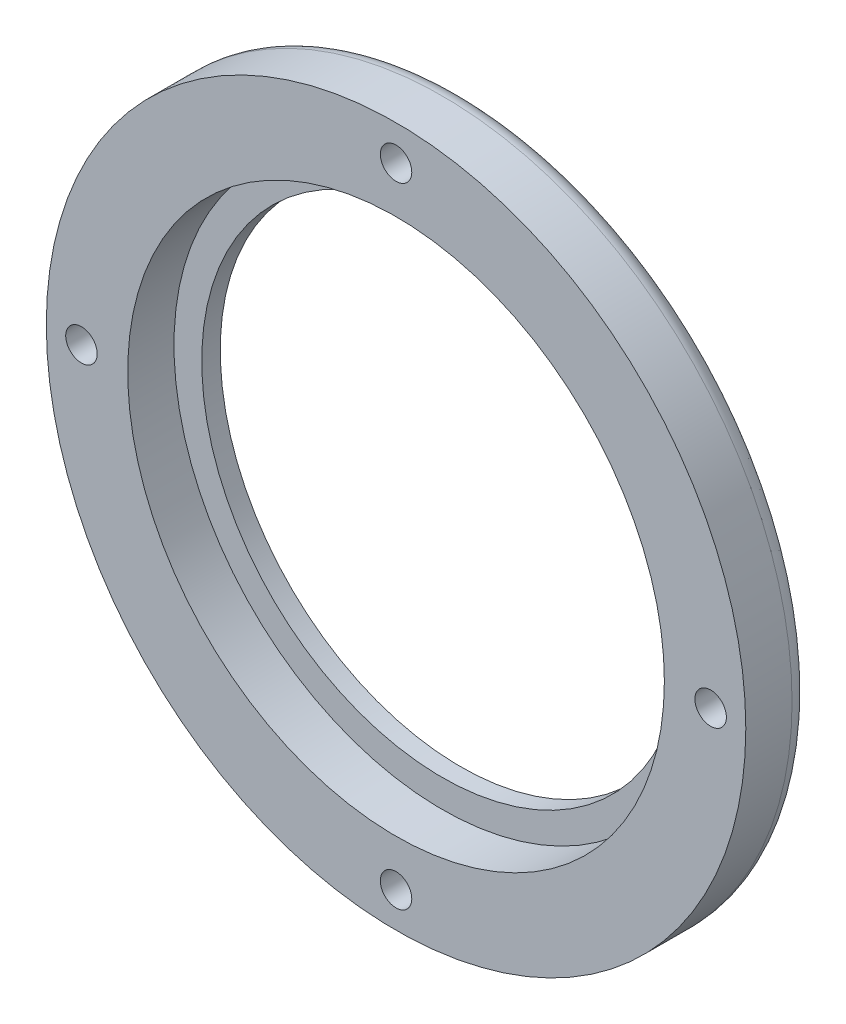
ISO-10303-21;
HEADER;
FILE_DESCRIPTION(('STEP AP214'),'2;1');
FILE_NAME('part.step','',(''),(''),'','','');
FILE_SCHEMA(('AUTOMOTIVE_DESIGN { 1 0 10303 214 1 1 1 1 }'));
ENDSEC;
DATA;
#1=APPLICATION_CONTEXT('core data for automotive mechanical design processes');
#2=APPLICATION_PROTOCOL_DEFINITION('international standard','automotive_design',2000,#1);
#3=PRODUCT_CONTEXT('',#1,'mechanical');
#4=PRODUCT('Part','Part','',(#3));
#5=PRODUCT_RELATED_PRODUCT_CATEGORY('part','',(#4));
#6=PRODUCT_DEFINITION_FORMATION('','',#4);
#7=PRODUCT_DEFINITION_CONTEXT('part definition',#1,'design');
#8=PRODUCT_DEFINITION('design','',#6,#7);
#9=PRODUCT_DEFINITION_SHAPE('','',#8);
#10=(LENGTH_UNIT() NAMED_UNIT(*) SI_UNIT(.MILLI.,.METRE.));
#11=(NAMED_UNIT(*) PLANE_ANGLE_UNIT() SI_UNIT($,.RADIAN.));
#12=(NAMED_UNIT(*) SI_UNIT($,.STERADIAN.) SOLID_ANGLE_UNIT());
#13=UNCERTAINTY_MEASURE_WITH_UNIT(LENGTH_MEASURE(1.E-05),#10,'distance_accuracy_value','');
#14=(GEOMETRIC_REPRESENTATION_CONTEXT(3) GLOBAL_UNCERTAINTY_ASSIGNED_CONTEXT((#13)) GLOBAL_UNIT_ASSIGNED_CONTEXT((#10,
#11,#12)) REPRESENTATION_CONTEXT('',''));
#15=CARTESIAN_POINT('',(0.,0.,0.));
#16=DIRECTION('',(0.,0.,1.));
#17=DIRECTION('',(1.,0.,0.));
#18=AXIS2_PLACEMENT_3D('',#15,#16,#17);
#19=CARTESIAN_POINT('',(34.,-3.58906191348806E-13,-1.));
#20=DIRECTION('',(0.,0.,1.));
#21=DIRECTION('',(1.,0.,0.));
#22=AXIS2_PLACEMENT_3D('',#19,#20,#21);
#23=CYLINDRICAL_SURFACE('',#22,1.7);
#24=CARTESIAN_POINT('',(34.,-3.58906191348806E-13,7.));
#25=DIRECTION('',(0.,0.,1.));
#26=DIRECTION('',(1.,0.,0.));
#27=AXIS2_PLACEMENT_3D('',#24,#25,#26);
#28=CIRCLE('',#27,1.7);
#29=CARTESIAN_POINT('',(35.7,-3.58906191348806E-13,7.));
#30=VERTEX_POINT('',#29);
#31=EDGE_CURVE('E130',#30,#30,#28,.T.);
#32=ORIENTED_EDGE('',*,*,#31,.T.);
#33=EDGE_LOOP('',(#32));
#34=FACE_BOUND('',#33,.T.);
#35=CARTESIAN_POINT('',(34.,-3.58906191348806E-13,2.5));
#36=DIRECTION('',(0.,0.,-1.));
#37=DIRECTION('',(-1.,0.,0.));
#38=AXIS2_PLACEMENT_3D('',#35,#36,#37);
#39=CIRCLE('',#38,1.7);
#40=CARTESIAN_POINT('',(32.3,-3.58906191348806E-13,2.5));
#41=VERTEX_POINT('',#40);
#42=EDGE_CURVE('E128',#41,#41,#39,.F.);
#43=ORIENTED_EDGE('',*,*,#42,.F.);
#44=EDGE_LOOP('',(#43));
#45=FACE_BOUND('',#44,.T.);
#46=ADVANCED_FACE('F40',(#34,#45),#23,.F.);
#47=CARTESIAN_POINT('',(2.33256931924232E-13,34.,-1.));
#48=DIRECTION('',(0.,0.,1.));
#49=DIRECTION('',(1.,0.,0.));
#50=AXIS2_PLACEMENT_3D('',#47,#48,#49);
#51=CYLINDRICAL_SURFACE('',#50,1.7);
#52=CARTESIAN_POINT('',(2.33256931924232E-13,34.,7.));
#53=DIRECTION('',(0.,0.,1.));
#54=DIRECTION('',(1.,0.,0.));
#55=AXIS2_PLACEMENT_3D('',#52,#53,#54);
#56=CIRCLE('',#55,1.7);
#57=CARTESIAN_POINT('',(1.70000000000023,34.,7.));
#58=VERTEX_POINT('',#57);
#59=EDGE_CURVE('E215',#58,#58,#56,.T.);
#60=ORIENTED_EDGE('',*,*,#59,.T.);
#61=EDGE_LOOP('',(#60));
#62=FACE_BOUND('',#61,.T.);
#63=CARTESIAN_POINT('',(2.33256931924232E-13,34.,2.5));
#64=DIRECTION('',(0.,0.,-1.));
#65=DIRECTION('',(-1.,0.,0.));
#66=AXIS2_PLACEMENT_3D('',#63,#64,#65);
#67=CIRCLE('',#66,1.7);
#68=CARTESIAN_POINT('',(-1.69999999999977,34.,2.5));
#69=VERTEX_POINT('',#68);
#70=EDGE_CURVE('E125',#69,#69,#67,.F.);
#71=ORIENTED_EDGE('',*,*,#70,.F.);
#72=EDGE_LOOP('',(#71));
#73=FACE_BOUND('',#72,.T.);
#74=ADVANCED_FACE('F159',(#62,#73),#51,.F.);
#75=CARTESIAN_POINT('',(-34.,1.21485460307473E-13,-1.));
#76=DIRECTION('',(0.,0.,1.));
#77=DIRECTION('',(1.,0.,0.));
#78=AXIS2_PLACEMENT_3D('',#75,#76,#77);
#79=CYLINDRICAL_SURFACE('',#78,1.7);
#80=CARTESIAN_POINT('',(-34.,1.21485460307473E-13,7.));
#81=DIRECTION('',(0.,0.,1.));
#82=DIRECTION('',(1.,0.,0.));
#83=AXIS2_PLACEMENT_3D('',#80,#81,#82);
#84=CIRCLE('',#83,1.7);
#85=CARTESIAN_POINT('',(-32.3,1.21485460307473E-13,7.));
#86=VERTEX_POINT('',#85);
#87=EDGE_CURVE('E218',#86,#86,#84,.T.);
#88=ORIENTED_EDGE('',*,*,#87,.T.);
#89=EDGE_LOOP('',(#88));
#90=FACE_BOUND('',#89,.T.);
#91=CARTESIAN_POINT('',(-34.,1.21485460307473E-13,2.5));
#92=DIRECTION('',(0.,0.,-1.));
#93=DIRECTION('',(-1.,0.,0.));
#94=AXIS2_PLACEMENT_3D('',#91,#92,#93);
#95=CIRCLE('',#94,1.7);
#96=CARTESIAN_POINT('',(-35.7,1.21485460307473E-13,2.5));
#97=VERTEX_POINT('',#96);
#98=EDGE_CURVE('E121',#97,#97,#95,.F.);
#99=ORIENTED_EDGE('',*,*,#98,.F.);
#100=EDGE_LOOP('',(#99));
#101=FACE_BOUND('',#100,.T.);
#102=ADVANCED_FACE('F155',(#90,#101),#79,.F.);
#103=CARTESIAN_POINT('',(0.,-34.,-1.));
#104=DIRECTION('',(0.,0.,1.));
#105=DIRECTION('',(1.,0.,0.));
#106=AXIS2_PLACEMENT_3D('',#103,#104,#105);
#107=CYLINDRICAL_SURFACE('',#106,1.7);
#108=CARTESIAN_POINT('',(0.,-34.,7.));
#109=DIRECTION('',(0.,0.,1.));
#110=DIRECTION('',(1.,0.,0.));
#111=AXIS2_PLACEMENT_3D('',#108,#109,#110);
#112=CIRCLE('',#111,1.7);
#113=CARTESIAN_POINT('',(1.7,-34.,7.));
#114=VERTEX_POINT('',#113);
#115=EDGE_CURVE('E211',#114,#114,#112,.T.);
#116=ORIENTED_EDGE('',*,*,#115,.T.);
#117=EDGE_LOOP('',(#116));
#118=FACE_BOUND('',#117,.T.);
#119=CARTESIAN_POINT('',(0.,-34.,2.5));
#120=DIRECTION('',(0.,0.,-1.));
#121=DIRECTION('',(-1.,0.,0.));
#122=AXIS2_PLACEMENT_3D('',#119,#120,#121);
#123=CIRCLE('',#122,1.7);
#124=CARTESIAN_POINT('',(-1.7,-34.,2.5));
#125=VERTEX_POINT('',#124);
#126=EDGE_CURVE('E118',#125,#125,#123,.F.);
#127=ORIENTED_EDGE('',*,*,#126,.F.);
#128=EDGE_LOOP('',(#127));
#129=FACE_BOUND('',#128,.T.);
#130=ADVANCED_FACE('F151',(#118,#129),#107,.F.);
#131=CARTESIAN_POINT('',(0.,0.,7.));
#132=DIRECTION('',(0.,0.,-1.));
#133=DIRECTION('',(-1.,0.,0.));
#134=AXIS2_PLACEMENT_3D('',#131,#132,#133);
#135=CYLINDRICAL_SURFACE('',#134,26.);
#136=CARTESIAN_POINT('',(0.,0.,0.));
#137=DIRECTION('',(0.,0.,1.));
#138=DIRECTION('',(1.,0.,0.));
#139=AXIS2_PLACEMENT_3D('',#136,#137,#138);
#140=CIRCLE('',#139,26.);
#141=CARTESIAN_POINT('',(26.,0.,0.));
#142=VERTEX_POINT('',#141);
#143=EDGE_CURVE('E195',#142,#142,#140,.T.);
#144=ORIENTED_EDGE('',*,*,#143,.F.);
#145=EDGE_LOOP('',(#144));
#146=FACE_BOUND('',#145,.T.);
#147=CARTESIAN_POINT('',(0.,0.,2.));
#148=DIRECTION('',(0.,0.,1.));
#149=DIRECTION('',(1.,0.,0.));
#150=AXIS2_PLACEMENT_3D('',#147,#148,#149);
#151=CIRCLE('',#150,26.);
#152=CARTESIAN_POINT('',(26.,0.,2.));
#153=VERTEX_POINT('',#152);
#154=EDGE_CURVE('E198',#153,#153,#151,.T.);
#155=ORIENTED_EDGE('',*,*,#154,.T.);
#156=EDGE_LOOP('',(#155));
#157=FACE_BOUND('',#156,.T.);
#158=ADVANCED_FACE('F154',(#146,#157),#135,.F.);
#159=CARTESIAN_POINT('',(0.,0.,7.));
#160=DIRECTION('',(0.,0.,1.));
#161=DIRECTION('',(1.,0.,0.));
#162=AXIS2_PLACEMENT_3D('',#159,#160,#161);
#163=PLANE('',#162);
#164=ORIENTED_EDGE('',*,*,#115,.F.);
#165=EDGE_LOOP('',(#164));
#166=FACE_BOUND('',#165,.T.);
#167=ORIENTED_EDGE('',*,*,#87,.F.);
#168=EDGE_LOOP('',(#167));
#169=FACE_BOUND('',#168,.T.);
#170=ORIENTED_EDGE('',*,*,#59,.F.);
#171=EDGE_LOOP('',(#170));
#172=FACE_BOUND('',#171,.T.);
#173=ORIENTED_EDGE('',*,*,#31,.F.);
#174=EDGE_LOOP('',(#173));
#175=FACE_BOUND('',#174,.T.);
#176=CARTESIAN_POINT('',(0.,0.,7.));
#177=DIRECTION('',(0.,0.,1.));
#178=DIRECTION('',(1.,0.,0.));
#179=AXIS2_PLACEMENT_3D('',#176,#177,#178);
#180=CIRCLE('',#179,29.);
#181=CARTESIAN_POINT('',(29.,0.,7.));
#182=VERTEX_POINT('',#181);
#183=EDGE_CURVE('E206',#182,#182,#180,.T.);
#184=ORIENTED_EDGE('',*,*,#183,.F.);
#185=EDGE_LOOP('',(#184));
#186=FACE_BOUND('',#185,.T.);
#187=CARTESIAN_POINT('',(0.,0.,7.));
#188=DIRECTION('',(0.,0.,1.));
#189=DIRECTION('',(1.,0.,0.));
#190=AXIS2_PLACEMENT_3D('',#187,#188,#189);
#191=CIRCLE('',#190,37.8);
#192=CARTESIAN_POINT('',(37.8,0.,7.));
#193=VERTEX_POINT('',#192);
#194=EDGE_CURVE('E193',#193,#193,#191,.T.);
#195=ORIENTED_EDGE('',*,*,#194,.T.);
#196=EDGE_LOOP('',(#195));
#197=FACE_BOUND('',#196,.T.);
#198=ADVANCED_FACE('F178',(#166,#169,#172,#175,#186,#197),#163,.T.);
#199=CARTESIAN_POINT('',(0.,0.,0.));
#200=DIRECTION('',(0.,0.,1.));
#201=DIRECTION('',(1.,0.,0.));
#202=AXIS2_PLACEMENT_3D('',#199,#200,#201);
#203=PLANE('',#202);
#204=CARTESIAN_POINT('',(0.,0.,0.));
#205=DIRECTION('',(0.,0.,1.));
#206=DIRECTION('',(1.,0.,0.));
#207=AXIS2_PLACEMENT_3D('',#204,#205,#206);
#208=CIRCLE('',#207,35.8);
#209=CARTESIAN_POINT('',(2.33193597915998,35.7239705882353,0.));
#210=VERTEX_POINT('',#209);
#211=CARTESIAN_POINT('',(35.7239705882353,2.33193597915935,0.));
#212=VERTEX_POINT('',#211);
#213=EDGE_CURVE('E112',#210,#212,#208,.F.);
#214=ORIENTED_EDGE('',*,*,#213,.T.);
#215=CARTESIAN_POINT('',(34.,-3.58906191348806E-13,0.));
#216=DIRECTION('',(0.,0.,-1.));
#217=DIRECTION('',(-1.,0.,0.));
#218=AXIS2_PLACEMENT_3D('',#215,#216,#217);
#219=CIRCLE('',#218,2.9);
#220=CARTESIAN_POINT('',(35.7239705882353,-2.33193597916011,0.));
#221=VERTEX_POINT('',#220);
#222=EDGE_CURVE('E59',#221,#212,#219,.T.);
#223=ORIENTED_EDGE('',*,*,#222,.F.);
#224=CARTESIAN_POINT('',(2.33193597915974,-35.7239705882353,0.));
#225=VERTEX_POINT('',#224);
#226=EDGE_CURVE('E95',#221,#225,#208,.F.);
#227=ORIENTED_EDGE('',*,*,#226,.T.);
#228=CARTESIAN_POINT('',(0.,-34.,0.));
#229=DIRECTION('',(0.,0.,-1.));
#230=DIRECTION('',(-1.,0.,0.));
#231=AXIS2_PLACEMENT_3D('',#228,#229,#230);
#232=CIRCLE('',#231,2.9);
#233=CARTESIAN_POINT('',(-2.33193597915973,-35.7239705882353,0.));
#234=VERTEX_POINT('',#233);
#235=EDGE_CURVE('E89',#234,#225,#232,.T.);
#236=ORIENTED_EDGE('',*,*,#235,.F.);
#237=CARTESIAN_POINT('',(-35.7239705882353,-2.33193597915961,0.));
#238=VERTEX_POINT('',#237);
#239=EDGE_CURVE('E103',#234,#238,#208,.F.);
#240=ORIENTED_EDGE('',*,*,#239,.T.);
#241=CARTESIAN_POINT('',(-34.,1.21485460307473E-13,0.));
#242=DIRECTION('',(0.,0.,-1.));
#243=DIRECTION('',(-1.,0.,0.));
#244=AXIS2_PLACEMENT_3D('',#241,#242,#243);
#245=CIRCLE('',#244,2.9);
#246=CARTESIAN_POINT('',(-35.7239705882353,2.33193597915986,0.));
#247=VERTEX_POINT('',#246);
#248=EDGE_CURVE('E227',#247,#238,#245,.T.);
#249=ORIENTED_EDGE('',*,*,#248,.F.);
#250=CARTESIAN_POINT('',(-2.33193597915948,35.7239705882353,0.));
#251=VERTEX_POINT('',#250);
#252=EDGE_CURVE('E110',#247,#251,#208,.F.);
#253=ORIENTED_EDGE('',*,*,#252,.T.);
#254=CARTESIAN_POINT('',(2.40195825828139E-13,34.,0.));
#255=DIRECTION('',(0.,0.,-1.));
#256=DIRECTION('',(-1.,0.,0.));
#257=AXIS2_PLACEMENT_3D('',#254,#255,#256);
#258=CIRCLE('',#257,2.9);
#259=EDGE_CURVE('E66',#210,#251,#258,.T.);
#260=ORIENTED_EDGE('',*,*,#259,.F.);
#261=EDGE_LOOP('',(#214,#223,#227,#236,#240,#249,#253,#260));
#262=FACE_BOUND('',#261,.T.);
#263=ORIENTED_EDGE('',*,*,#143,.T.);
#264=EDGE_LOOP('',(#263));
#265=FACE_BOUND('',#264,.T.);
#266=ADVANCED_FACE('F100',(#262,#265),#203,.F.);
#267=CARTESIAN_POINT('',(0.,0.,7.));
#268=DIRECTION('',(0.,0.,-1.));
#269=DIRECTION('',(-1.,0.,0.));
#270=AXIS2_PLACEMENT_3D('',#267,#268,#269);
#271=CYLINDRICAL_SURFACE('',#270,37.8);
#272=CARTESIAN_POINT('',(0.,0.,2.));
#273=DIRECTION('',(0.,0.,1.));
#274=DIRECTION('',(1.,0.,0.));
#275=AXIS2_PLACEMENT_3D('',#272,#273,#274);
#276=CIRCLE('',#275,37.8);
#277=CARTESIAN_POINT('',(37.8,0.,2.));
#278=VERTEX_POINT('',#277);
#279=EDGE_CURVE('E116',#278,#278,#276,.T.);
#280=ORIENTED_EDGE('',*,*,#279,.T.);
#281=EDGE_LOOP('',(#280));
#282=FACE_BOUND('',#281,.T.);
#283=ORIENTED_EDGE('',*,*,#194,.F.);
#284=EDGE_LOOP('',(#283));
#285=FACE_BOUND('',#284,.T.);
#286=ADVANCED_FACE('F174',(#282,#285),#271,.T.);
#287=CARTESIAN_POINT('',(0.,0.,2.));
#288=DIRECTION('',(0.,0.,1.));
#289=DIRECTION('',(1.,0.,0.));
#290=AXIS2_PLACEMENT_3D('',#287,#288,#289);
#291=CYLINDRICAL_SURFACE('',#290,29.);
#292=CARTESIAN_POINT('',(0.,0.,2.));
#293=DIRECTION('',(0.,0.,1.));
#294=DIRECTION('',(1.,0.,0.));
#295=AXIS2_PLACEMENT_3D('',#292,#293,#294);
#296=CIRCLE('',#295,29.);
#297=CARTESIAN_POINT('',(29.,0.,2.));
#298=VERTEX_POINT('',#297);
#299=EDGE_CURVE('E202',#298,#298,#296,.T.);
#300=ORIENTED_EDGE('',*,*,#299,.F.);
#301=EDGE_LOOP('',(#300));
#302=FACE_BOUND('',#301,.T.);
#303=ORIENTED_EDGE('',*,*,#183,.T.);
#304=EDGE_LOOP('',(#303));
#305=FACE_BOUND('',#304,.T.);
#306=ADVANCED_FACE('F170',(#302,#305),#291,.F.);
#307=CARTESIAN_POINT('',(0.,0.,2.));
#308=DIRECTION('',(0.,0.,1.));
#309=DIRECTION('',(1.,0.,0.));
#310=AXIS2_PLACEMENT_3D('',#307,#308,#309);
#311=PLANE('',#310);
#312=ORIENTED_EDGE('',*,*,#154,.F.);
#313=EDGE_LOOP('',(#312));
#314=FACE_BOUND('',#313,.T.);
#315=ORIENTED_EDGE('',*,*,#299,.T.);
#316=EDGE_LOOP('',(#315));
#317=FACE_BOUND('',#316,.T.);
#318=ADVANCED_FACE('F167',(#314,#317),#311,.T.);
#319=CARTESIAN_POINT('',(0.,0.,2.));
#320=DIRECTION('',(0.,0.,1.));
#321=DIRECTION('',(1.,0.,0.));
#322=AXIS2_PLACEMENT_3D('',#319,#320,#321);
#323=TOROIDAL_SURFACE('',#322,35.8,2.);
#324=CARTESIAN_POINT('',(33.6769117746471,2.8819462171658,2.0002));
#325=CARTESIAN_POINT('',(33.6769019662557,2.88193301000173,1.94412417231844));
#326=CARTESIAN_POINT('',(33.6792451408607,2.88220749489008,1.88805087356838));
#327=CARTESIAN_POINT('',(33.6886040835122,2.88324005083849,1.77630242565175));
#328=CARTESIAN_POINT('',(33.6956196453491,2.88399810055698,1.72062725902374));
#329=CARTESIAN_POINT('',(33.7142923925436,2.88590624827923,1.61004895021777));
#330=CARTESIAN_POINT('',(33.7259507695862,2.88705644692609,1.55514600999811));
#331=CARTESIAN_POINT('',(33.7538296562477,2.88956640692947,1.44653236546983));
#332=CARTESIAN_POINT('',(33.7700501259912,2.89092616645425,1.39282165074489));
#333=CARTESIAN_POINT('',(33.8254599332222,2.89498384776472,1.23397289324904));
#334=CARTESIAN_POINT('',(33.8714016597399,2.89766075449593,1.13109463670949));
#335=CARTESIAN_POINT('',(33.9800686548637,2.90043711895356,0.934671848108845));
#336=CARTESIAN_POINT('',(34.0427867993572,2.90053766898072,0.841123377246145));
#337=CARTESIAN_POINT('',(34.1820014481896,2.89510484278048,0.667628417655143));
#338=CARTESIAN_POINT('',(34.2582459035088,2.88966710500999,0.587477932945119));
#339=CARTESIAN_POINT('',(34.4224236673637,2.8702538128241,0.441476697976109));
#340=CARTESIAN_POINT('',(34.5103487557854,2.85628423794836,0.375615976506834));
#341=CARTESIAN_POINT('',(34.6872451281448,2.81873268692289,0.264208182114245));
#342=CARTESIAN_POINT('',(34.7756689291825,2.79592900464463,0.217527218175826));
#343=CARTESIAN_POINT('',(34.9554368545129,2.73970761364595,0.138422687999119));
#344=CARTESIAN_POINT('',(35.0467804364244,2.70629186604597,0.105996490103349));
#345=CARTESIAN_POINT('',(35.2257459468278,2.62996461921755,0.0555102071498546));
#346=CARTESIAN_POINT('',(35.3133938128686,2.58738910284884,0.0370258304653582));
#347=CARTESIAN_POINT('',(35.4851388077337,2.49278955528153,0.0112278713577212));
#348=CARTESIAN_POINT('',(35.5692338021015,2.44075994110505,0.00392091373722555));
#349=CARTESIAN_POINT('',(35.7614162865745,2.30771825669873,-0.00246648493779885));
#350=CARTESIAN_POINT('',(35.8671045738612,2.22304795389405,0.00241210886987915));
#351=CARTESIAN_POINT('',(36.0650343659469,2.04055188822127,0.0239393173129992));
#352=CARTESIAN_POINT('',(36.1572553943144,1.94270651850603,0.0406056344699227));
#353=CARTESIAN_POINT('',(36.3281921493637,1.73435280474962,0.0809616786448039));
#354=CARTESIAN_POINT('',(36.4066495797893,1.62365631720821,0.104766783330279));
#355=CARTESIAN_POINT('',(36.5472672707067,1.39275013737489,0.154345977257815));
#356=CARTESIAN_POINT('',(36.6094163358502,1.27253398334834,0.180121403490907));
#357=CARTESIAN_POINT('',(36.7280349705352,0.997360061274029,0.234050889498394));
#358=CARTESIAN_POINT('',(36.78045779823,0.840465338297592,0.261537544079876));
#359=CARTESIAN_POINT('',(36.8386198604133,0.599246685996718,0.293621711925992));
#360=CARTESIAN_POINT('',(36.8545939128901,0.517879694972608,0.302791114202787));
#361=CARTESIAN_POINT('',(36.8795411833824,0.353724976117443,0.31734893495778));
#362=CARTESIAN_POINT('',(36.8885157369704,0.270937522407029,0.322738074727038));
#363=CARTESIAN_POINT('',(36.8988814046875,0.111261875014332,0.328984131795167));
#364=CARTESIAN_POINT('',(36.9008124074433,0.0344206223566678,0.330163554898558));
#365=CARTESIAN_POINT('',(36.8985688378572,-0.119138812313803,0.328802436745329));
#366=CARTESIAN_POINT('',(36.8943944356401,-0.195856997696201,0.326261999141218));
#367=CARTESIAN_POINT('',(36.8799997421531,-0.34854347948866,0.317658307417866));
#368=CARTESIAN_POINT('',(36.869777770833,-0.424511561550919,0.311594074375996));
#369=CARTESIAN_POINT('',(36.8434299096998,-0.575117372900177,0.296406222122173));
#370=CARTESIAN_POINT('',(36.8273013690133,-0.649754489051289,0.287281229393521));
#371=CARTESIAN_POINT('',(36.7730140253608,-0.860444843406485,0.25773018292704));
#372=CARTESIAN_POINT('',(36.7278196570245,-0.99432901614525,0.234320017668296));
#373=CARTESIAN_POINT('',(36.6188345462308,-1.25362316519998,0.184101590821938));
#374=CARTESIAN_POINT('',(36.555021958478,-1.37902297241905,0.157289358494792));
#375=CARTESIAN_POINT('',(36.3982013017103,-1.63859918350332,0.101562124716004));
#376=CARTESIAN_POINT('',(36.3021860726778,-1.77107455572553,0.0729754016640827));
#377=CARTESIAN_POINT('',(36.1417859084915,-1.95689974771047,0.0386535757255));
#378=CARTESIAN_POINT('',(36.0856100669992,-2.01667656410821,0.0286411656397888));
#379=CARTESIAN_POINT('',(35.9681108550976,-2.13149733417604,0.0126168221998489));
#380=CARTESIAN_POINT('',(35.9067901519978,-2.18654371070188,0.00660283015736552));
#381=CARTESIAN_POINT('',(35.755714834184,-2.31089847962317,-0.00148630891377015));
#382=CARTESIAN_POINT('',(35.663875389275,-2.3778842804981,-0.00126065011129347));
#383=CARTESIAN_POINT('',(35.4736479887821,-2.50022468622822,0.0121846580858508));
#384=CARTESIAN_POINT('',(35.3752663788109,-2.55559035151189,0.0253918825048772));
#385=CARTESIAN_POINT('',(35.1746318908158,-2.65382605117189,0.0677189568998372));
#386=CARTESIAN_POINT('',(35.0723551280056,-2.69659710079714,0.0969599457270315));
#387=CARTESIAN_POINT('',(34.8696153462467,-2.76863397231282,0.173097896656812));
#388=CARTESIAN_POINT('',(34.7691514534282,-2.79790647767133,0.219986100248817));
#389=CARTESIAN_POINT('',(34.5869003511555,-2.84135348464916,0.324630182397839));
#390=CARTESIAN_POINT('',(34.5043114640715,-2.85690726812083,0.38043653603006));
#391=CARTESIAN_POINT('',(34.3478421553684,-2.88015070698599,0.504486186323146));
#392=CARTESIAN_POINT('',(34.2739623214124,-2.88783983196226,0.572730321461326));
#393=CARTESIAN_POINT('',(34.1374598466828,-2.89754967630448,0.719762604287764));
#394=CARTESIAN_POINT('',(34.0748189902853,-2.89957964685767,0.798533322644665));
#395=CARTESIAN_POINT('',(33.9622470890663,-2.90030191347589,0.964729197271115));
#396=CARTESIAN_POINT('',(33.9123230788325,-2.89899236660847,1.05215910657726));
#397=CARTESIAN_POINT('',(33.8230256235635,-2.89496758498431,1.24044629071295));
#398=CARTESIAN_POINT('',(33.7847443723196,-2.89215294958475,1.34181906425014));
#399=CARTESIAN_POINT('',(33.7250931545763,-2.88709792927767,1.54936577281653));
#400=CARTESIAN_POINT('',(33.7037039848247,-2.88485689425535,1.65553411051295));
#401=CARTESIAN_POINT('',(33.6862768057638,-2.88298287162753,1.80207369232352));
#402=CARTESIAN_POINT('',(33.6827594883142,-2.88259662478854,1.84165199135714));
#403=CARTESIAN_POINT('',(33.6780779086529,-2.88207779659807,1.92088168377782));
#404=CARTESIAN_POINT('',(33.6769096556318,-2.88194478504737,1.96053283845396));
#405=CARTESIAN_POINT('',(33.676911774647,-2.88194621716651,2.0002));
#406=B_SPLINE_CURVE_WITH_KNOTS('',3,(#324,#325,#326,#327,#328,#329,#330,#331,#332,#333,#334,
#335,#336,#337,#338,#339,#340,#341,#342,#343,#344,#345,#346,#347,#348,#349,#350,#351,#352,#353,
#354,#355,#356,#357,#358,#359,#360,#361,#362,#363,#364,#365,#366,#367,#368,#369,#370,#371,#372,
#373,#374,#375,#376,#377,#378,#379,#380,#381,#382,#383,#384,#385,#386,#387,#388,#389,#390,#391,
#392,#393,#394,#395,#396,#397,#398,#399,#400,#401,#402,#403,#404,#405),.UNSPECIFIED.,.F.,.F.,(4,
2,2,2,2,2,2,2,2,2,2,2,2,2,2,2,2,2,2,2,2,2,2,2,2,2,2,2,2,2,2,2,2,2,2,2,2,2,2,2,4),(0.,
0.168172668836522,0.336337916081387,0.504546354641972,0.672753323006579,1.00909633501532,
1.34529674495413,1.67578827012788,2.00604843562876,2.31213883323093,2.61817269790118,
2.91446871813939,3.2109402836569,3.61524957654571,4.02016734426764,4.43201866556609,
4.84415197879983,5.34429206739958,5.59425151477456,5.84416325578209,6.07446129342222,
6.30475291401701,6.53510854103149,6.76556767879838,7.19348013654633,7.62189670947092,
8.11740608465621,8.36500359067312,8.61247351582398,8.95209974026211,9.29140121631262,
9.63330224016668,9.97503379799771,10.2762190388284,10.5774245911966,10.8781374643884,
11.1790163236668,11.5027949710981,11.8262050085829,11.9453593553058,12.0643110999128),.UNSPECIFIED.);
#407=EDGE_CURVE('E11',#212,#221,#406,.T.);
#408=ORIENTED_EDGE('',*,*,#407,.F.);
#409=ORIENTED_EDGE('',*,*,#213,.F.);
#410=CARTESIAN_POINT('',(-2.88194621716591,33.6769117746471,2.0002));
#411=CARTESIAN_POINT('',(-2.88193301000185,33.6769019662557,1.94412417231844));
#412=CARTESIAN_POINT('',(-2.88220749489019,33.6792451408607,1.88805087356838));
#413=CARTESIAN_POINT('',(-2.8832400508386,33.6886040835122,1.77630242565176));
#414=CARTESIAN_POINT('',(-2.8839981005571,33.6956196453491,1.72062725902374));
#415=CARTESIAN_POINT('',(-2.88590624827935,33.7142923925435,1.61004895021777));
#416=CARTESIAN_POINT('',(-2.88705644692621,33.7259507695862,1.55514600999811));
#417=CARTESIAN_POINT('',(-2.88956640692959,33.7538296562477,1.44653236546984));
#418=CARTESIAN_POINT('',(-2.89092616645437,33.7700501259912,1.3928216507449));
#419=CARTESIAN_POINT('',(-2.89498384776484,33.8254599332222,1.23397289324904));
#420=CARTESIAN_POINT('',(-2.89766075449605,33.8714016597399,1.13109463670949));
#421=CARTESIAN_POINT('',(-2.90043711895368,33.9800686548636,0.934671848108849));
#422=CARTESIAN_POINT('',(-2.90053766898084,34.0427867993571,0.841123377246148));
#423=CARTESIAN_POINT('',(-2.89510484278061,34.1820014481895,0.667628417655147));
#424=CARTESIAN_POINT('',(-2.88966710501011,34.2582459035088,0.587477932945127));
#425=CARTESIAN_POINT('',(-2.87025381282422,34.4224236673637,0.441476697976114));
#426=CARTESIAN_POINT('',(-2.85628423794848,34.5103487557854,0.375615976506833));
#427=CARTESIAN_POINT('',(-2.81873268692301,34.6872451281448,0.264208182114241));
#428=CARTESIAN_POINT('',(-2.79592900464475,34.7756689291825,0.217527218175822));
#429=CARTESIAN_POINT('',(-2.73970761364607,34.9554368545129,0.138422687999117));
#430=CARTESIAN_POINT('',(-2.70629186604609,35.0467804364244,0.10599649010335));
#431=CARTESIAN_POINT('',(-2.62996461921767,35.2257459468278,0.0555102071498547));
#432=CARTESIAN_POINT('',(-2.58738910284896,35.3133938128686,0.037025830465357));
#433=CARTESIAN_POINT('',(-2.49278955528165,35.4851388077337,0.0112278713577195));
#434=CARTESIAN_POINT('',(-2.44075994110517,35.5692338021015,0.00392091373722481));
#435=CARTESIAN_POINT('',(-2.30771825669886,35.7614162865745,-0.00246648493779842));
#436=CARTESIAN_POINT('',(-2.22304795389417,35.8671045738612,0.0024121088698798));
#437=CARTESIAN_POINT('',(-2.04055188822139,36.0650343659469,0.0239393173130005));
#438=CARTESIAN_POINT('',(-1.94270651850615,36.1572553943144,0.0406056344699243));
#439=CARTESIAN_POINT('',(-1.73435280474974,36.3281921493637,0.0809616786448061));
#440=CARTESIAN_POINT('',(-1.62365631720832,36.4066495797893,0.104766783330282));
#441=CARTESIAN_POINT('',(-1.392750137375,36.5472672707067,0.15434597725782));
#442=CARTESIAN_POINT('',(-1.27253398334845,36.6094163358502,0.180121403490913));
#443=CARTESIAN_POINT('',(-0.997360061274138,36.7280349705353,0.234050889498399));
#444=CARTESIAN_POINT('',(-0.840465338297702,36.78045779823,0.261537544079879));
#445=CARTESIAN_POINT('',(-0.599246685996829,36.8386198604133,0.293621711925993));
#446=CARTESIAN_POINT('',(-0.517879694972719,36.8545939128901,0.302791114202788));
#447=CARTESIAN_POINT('',(-0.353724976117556,36.8795411833824,0.317348934957781));
#448=CARTESIAN_POINT('',(-0.270937522407144,36.8885157369704,0.322738074727039));
#449=CARTESIAN_POINT('',(-0.111261875014448,36.8988814046875,0.328984131795167));
#450=CARTESIAN_POINT('',(-0.0344206223567841,36.9008124074433,0.330163554898558));
#451=CARTESIAN_POINT('',(0.119138812313687,36.8985688378572,0.32880243674533));
#452=CARTESIAN_POINT('',(0.195856997696085,36.8943944356401,0.326261999141218));
#453=CARTESIAN_POINT('',(0.348543479488544,36.8799997421531,0.317658307417867));
#454=CARTESIAN_POINT('',(0.424511561550802,36.869777770833,0.311594074375998));
#455=CARTESIAN_POINT('',(0.57511737290006,36.8434299096998,0.296406222122172));
#456=CARTESIAN_POINT('',(0.649754489051171,36.8273013690133,0.287281229393518));
#457=CARTESIAN_POINT('',(0.860444843406367,36.7730140253608,0.257730182927034));
#458=CARTESIAN_POINT('',(0.994329016145133,36.7278196570245,0.23432001766829));
#459=CARTESIAN_POINT('',(1.25362316519986,36.6188345462308,0.184101590821936));
#460=CARTESIAN_POINT('',(1.37902297241893,36.555021958478,0.157289358494791));
#461=CARTESIAN_POINT('',(1.63859918350321,36.3982013017103,0.101562124716004));
#462=CARTESIAN_POINT('',(1.77107455572541,36.3021860726778,0.0729754016640805));
#463=CARTESIAN_POINT('',(1.95689974771035,36.1417859084915,0.0386535757254981));
#464=CARTESIAN_POINT('',(2.01667656410809,36.0856100669992,0.0286411656397875));
#465=CARTESIAN_POINT('',(2.13149733417592,35.9681108550976,0.012616822199848));
#466=CARTESIAN_POINT('',(2.18654371070176,35.9067901519978,0.00660283015736433));
#467=CARTESIAN_POINT('',(2.31089847962306,35.755714834184,-0.00148630891377046));
#468=CARTESIAN_POINT('',(2.37788428049799,35.663875389275,-0.00126065011129278));
#469=CARTESIAN_POINT('',(2.5002246862281,35.4736479887821,0.012184658085852));
#470=CARTESIAN_POINT('',(2.55559035151177,35.3752663788109,0.0253918825048783));
#471=CARTESIAN_POINT('',(2.65382605117177,35.1746318908158,0.0677189568998382));
#472=CARTESIAN_POINT('',(2.69659710079703,35.0723551280056,0.0969599457270327));
#473=CARTESIAN_POINT('',(2.7686339723127,34.8696153462467,0.173097896656815));
#474=CARTESIAN_POINT('',(2.79790647767121,34.7691514534282,0.219986100248822));
#475=CARTESIAN_POINT('',(2.84135348464904,34.5869003511555,0.324630182397842));
#476=CARTESIAN_POINT('',(2.85690726812071,34.5043114640715,0.380436536030061));
#477=CARTESIAN_POINT('',(2.88015070698587,34.3478421553684,0.504486186323147));
#478=CARTESIAN_POINT('',(2.88783983196214,34.2739623214124,0.57273032146133));
#479=CARTESIAN_POINT('',(2.89754967630436,34.1374598466828,0.719762604287769));
#480=CARTESIAN_POINT('',(2.89957964685755,34.0748189902853,0.79853332264467));
#481=CARTESIAN_POINT('',(2.90030191347578,33.9622470890663,0.96472919727112));
#482=CARTESIAN_POINT('',(2.89899236660835,33.9123230788325,1.05215910657726));
#483=CARTESIAN_POINT('',(2.89496758498419,33.8230256235635,1.24044629071296));
#484=CARTESIAN_POINT('',(2.89215294958464,33.7847443723196,1.34181906425014));
#485=CARTESIAN_POINT('',(2.88709792927755,33.7250931545763,1.54936577281653));
#486=CARTESIAN_POINT('',(2.88485689425523,33.7037039848247,1.65553411051295));
#487=CARTESIAN_POINT('',(2.88298287162741,33.6862768057638,1.80207369232352));
#488=CARTESIAN_POINT('',(2.88259662478843,33.6827594883142,1.84165199135714));
#489=CARTESIAN_POINT('',(2.88207779659795,33.6780779086529,1.92088168377782));
#490=CARTESIAN_POINT('',(2.88194478504725,33.6769096556318,1.96053283845396));
#491=CARTESIAN_POINT('',(2.88194621716639,33.676911774647,2.0002));
#492=B_SPLINE_CURVE_WITH_KNOTS('',3,(#410,#411,#412,#413,#414,#415,#416,#417,#418,#419,#420,
#421,#422,#423,#424,#425,#426,#427,#428,#429,#430,#431,#432,#433,#434,#435,#436,#437,#438,#439,
#440,#441,#442,#443,#444,#445,#446,#447,#448,#449,#450,#451,#452,#453,#454,#455,#456,#457,#458,
#459,#460,#461,#462,#463,#464,#465,#466,#467,#468,#469,#470,#471,#472,#473,#474,#475,#476,#477,
#478,#479,#480,#481,#482,#483,#484,#485,#486,#487,#488,#489,#490,#491),.UNSPECIFIED.,.F.,.F.,(4,
2,2,2,2,2,2,2,2,2,2,2,2,2,2,2,2,2,2,2,2,2,2,2,2,2,2,2,2,2,2,2,2,2,2,2,2,2,2,2,4),(0.,
0.168172668836521,0.336337916081385,0.504546354641973,0.672753323006578,1.00909633501532,
1.34529674495413,1.67578827012787,2.00604843562877,2.31213883323094,2.61817269790119,
2.9144687181394,3.21094028365691,3.61524957654572,4.02016734426766,4.43201866556612,
4.84415197879986,5.34429206739961,5.59425151477458,5.84416325578211,6.07446129342224,
6.30475291401702,6.53510854103151,6.7655676787984,7.19348013654635,7.62189670947094,
8.11740608465623,8.36500359067314,8.612473515824,8.95209974026213,9.29140121631264,
9.6333022401667,9.97503379799772,10.2762190388284,10.5774245911967,10.8781374643884,
11.1790163236668,11.5027949710981,11.8262050085829,11.9453593553058,12.0643110999128),.UNSPECIFIED.);
#493=EDGE_CURVE('E54',#251,#210,#492,.T.);
#494=ORIENTED_EDGE('',*,*,#493,.F.);
#495=ORIENTED_EDGE('',*,*,#252,.F.);
#496=CARTESIAN_POINT('',(-33.6769117746471,-2.88194621716603,2.0002));
#497=CARTESIAN_POINT('',(-33.6769019662557,-2.88193301000197,1.94412417231843));
#498=CARTESIAN_POINT('',(-33.6792451408606,-2.88220749489031,1.88805087356838));
#499=CARTESIAN_POINT('',(-33.6886040835122,-2.88324005083872,1.77630242565175));
#500=CARTESIAN_POINT('',(-33.6956196453491,-2.88399810055722,1.72062725902374));
#501=CARTESIAN_POINT('',(-33.7142923925435,-2.88590624827947,1.61004895021777));
#502=CARTESIAN_POINT('',(-33.7259507695862,-2.88705644692633,1.5551460099981));
#503=CARTESIAN_POINT('',(-33.7538296562477,-2.88956640692971,1.44653236546983));
#504=CARTESIAN_POINT('',(-33.7700501259912,-2.89092616645449,1.39282165074489));
#505=CARTESIAN_POINT('',(-33.8254599332222,-2.89498384776496,1.23397289324904));
#506=CARTESIAN_POINT('',(-33.8714016597399,-2.89766075449617,1.13109463670949));
#507=CARTESIAN_POINT('',(-33.9800686548636,-2.9004371189538,0.934671848108842));
#508=CARTESIAN_POINT('',(-34.0427867993571,-2.90053766898095,0.841123377246136));
#509=CARTESIAN_POINT('',(-34.1820014481895,-2.89510484278072,0.667628417655135));
#510=CARTESIAN_POINT('',(-34.2582459035088,-2.88966710501023,0.587477932945116));
#511=CARTESIAN_POINT('',(-34.4224236673637,-2.87025381282434,0.441476697976104));
#512=CARTESIAN_POINT('',(-34.5103487557854,-2.8562842379486,0.375615976506822));
#513=CARTESIAN_POINT('',(-34.6872451281448,-2.81873268692313,0.264208182114233));
#514=CARTESIAN_POINT('',(-34.7756689291825,-2.79592900464487,0.217527218175818));
#515=CARTESIAN_POINT('',(-34.9554368545129,-2.73970761364619,0.138422687999116));
#516=CARTESIAN_POINT('',(-35.0467804364244,-2.70629186604621,0.105996490103347));
#517=CARTESIAN_POINT('',(-35.2257459468278,-2.6299646192178,0.0555102071498523));
#518=CARTESIAN_POINT('',(-35.3133938128686,-2.58738910284908,0.0370258304653566));
#519=CARTESIAN_POINT('',(-35.4851388077337,-2.49278955528177,0.0112278713577203));
#520=CARTESIAN_POINT('',(-35.5692338021015,-2.4407599411053,0.00392091373722486));
#521=CARTESIAN_POINT('',(-35.7614162865745,-2.30771825669898,-0.00246648493779919));
#522=CARTESIAN_POINT('',(-35.8671045738612,-2.2230479538943,0.00241210886987935));
#523=CARTESIAN_POINT('',(-36.0650343659469,-2.04055188822152,0.0239393173130004));
#524=CARTESIAN_POINT('',(-36.1572553943144,-1.94270651850627,0.0406056344699243));
#525=CARTESIAN_POINT('',(-36.3281921493637,-1.73435280474987,0.080961678644806));
#526=CARTESIAN_POINT('',(-36.4066495797893,-1.62365631720845,0.104766783330281));
#527=CARTESIAN_POINT('',(-36.5472672707067,-1.39275013737514,0.154345977257821));
#528=CARTESIAN_POINT('',(-36.6094163358502,-1.27253398334858,0.180121403490915));
#529=CARTESIAN_POINT('',(-36.7280349705352,-0.997360061274273,0.234050889498399));
#530=CARTESIAN_POINT('',(-36.78045779823,-0.840465338297837,0.261537544079874));
#531=CARTESIAN_POINT('',(-36.8386198604133,-0.599246685996965,0.293621711925993));
#532=CARTESIAN_POINT('',(-36.8545939128901,-0.517879694972856,0.30279111420279));
#533=CARTESIAN_POINT('',(-36.8795411833824,-0.353724976117692,0.317348934957785));
#534=CARTESIAN_POINT('',(-36.8885157369704,-0.270937522407278,0.32273807472704));
#535=CARTESIAN_POINT('',(-36.8988814046875,-0.111261875014582,0.328984131795165));
#536=CARTESIAN_POINT('',(-36.9008124074433,-0.0344206223569182,0.330163554898553));
#537=CARTESIAN_POINT('',(-36.8985688378572,0.119138812313552,0.328802436745326));
#538=CARTESIAN_POINT('',(-36.8943944356401,0.195856997695951,0.326261999141218));
#539=CARTESIAN_POINT('',(-36.8799997421531,0.34854347948841,0.317658307417869));
#540=CARTESIAN_POINT('',(-36.869777770833,0.424511561550668,0.311594074375999));
#541=CARTESIAN_POINT('',(-36.8434299096998,0.575117372899926,0.296406222122174));
#542=CARTESIAN_POINT('',(-36.8273013690133,0.649754489051038,0.28728122939352));
#543=CARTESIAN_POINT('',(-36.7730140253609,0.860444843406233,0.257730182927037));
#544=CARTESIAN_POINT('',(-36.7278196570245,0.994329016144999,0.234320017668294));
#545=CARTESIAN_POINT('',(-36.6188345462308,1.25362316519972,0.184101590821939));
#546=CARTESIAN_POINT('',(-36.555021958478,1.3790229724188,0.157289358494793));
#547=CARTESIAN_POINT('',(-36.3982013017103,1.63859918350307,0.101562124716005));
#548=CARTESIAN_POINT('',(-36.3021860726779,1.77107455572527,0.0729754016640817));
#549=CARTESIAN_POINT('',(-36.1417859084916,1.95689974771022,0.0386535757254997));
#550=CARTESIAN_POINT('',(-36.0856100669992,2.01667656410796,0.0286411656397893));
#551=CARTESIAN_POINT('',(-35.9681108550977,2.13149733417579,0.012616822199849));
#552=CARTESIAN_POINT('',(-35.9067901519979,2.18654371070163,0.00660283015736468));
#553=CARTESIAN_POINT('',(-35.755714834184,2.31089847962293,-0.00148630891377091));
#554=CARTESIAN_POINT('',(-35.663875389275,2.37788428049786,-0.00126065011129297));
#555=CARTESIAN_POINT('',(-35.4736479887821,2.50022468622797,0.0121846580858513));
#556=CARTESIAN_POINT('',(-35.3752663788109,2.55559035151165,0.0253918825048769));
#557=CARTESIAN_POINT('',(-35.1746318908158,2.65382605117165,0.0677189568998368));
#558=CARTESIAN_POINT('',(-35.0723551280056,2.6965971007969,0.0969599457270316));
#559=CARTESIAN_POINT('',(-34.8696153462467,2.76863397231257,0.173097896656813));
#560=CARTESIAN_POINT('',(-34.7691514534282,2.79790647767109,0.219986100248818));
#561=CARTESIAN_POINT('',(-34.5869003511555,2.84135348464892,0.324630182397837));
#562=CARTESIAN_POINT('',(-34.5043114640715,2.85690726812059,0.380436536030055));
#563=CARTESIAN_POINT('',(-34.3478421553684,2.88015070698575,0.504486186323142));
#564=CARTESIAN_POINT('',(-34.2739623214124,2.88783983196202,0.572730321461326));
#565=CARTESIAN_POINT('',(-34.1374598466828,2.89754967630424,0.719762604287767));
#566=CARTESIAN_POINT('',(-34.0748189902853,2.89957964685743,0.798533322644669));
#567=CARTESIAN_POINT('',(-33.9622470890663,2.90030191347566,0.964729197271121));
#568=CARTESIAN_POINT('',(-33.9123230788326,2.89899236660824,1.05215910657726));
#569=CARTESIAN_POINT('',(-33.8230256235635,2.89496758498407,1.24044629071296));
#570=CARTESIAN_POINT('',(-33.7847443723196,2.89215294958452,1.34181906425015));
#571=CARTESIAN_POINT('',(-33.7250931545763,2.88709792927743,1.54936577281653));
#572=CARTESIAN_POINT('',(-33.7037039848247,2.88485689425511,1.65553411051295));
#573=CARTESIAN_POINT('',(-33.6862768057638,2.88298287162729,1.80207369232352));
#574=CARTESIAN_POINT('',(-33.6827594883142,2.88259662478831,1.84165199135714));
#575=CARTESIAN_POINT('',(-33.6780779086529,2.88207779659783,1.92088168377782));
#576=CARTESIAN_POINT('',(-33.6769096556318,2.88194478504713,1.96053283845396));
#577=CARTESIAN_POINT('',(-33.6769117746471,2.88194621716627,2.0002));
#578=B_SPLINE_CURVE_WITH_KNOTS('',3,(#496,#497,#498,#499,#500,#501,#502,#503,#504,#505,#506,
#507,#508,#509,#510,#511,#512,#513,#514,#515,#516,#517,#518,#519,#520,#521,#522,#523,#524,#525,
#526,#527,#528,#529,#530,#531,#532,#533,#534,#535,#536,#537,#538,#539,#540,#541,#542,#543,#544,
#545,#546,#547,#548,#549,#550,#551,#552,#553,#554,#555,#556,#557,#558,#559,#560,#561,#562,#563,
#564,#565,#566,#567,#568,#569,#570,#571,#572,#573,#574,#575,#576,#577),.UNSPECIFIED.,.F.,.F.,(4,
2,2,2,2,2,2,2,2,2,2,2,2,2,2,2,2,2,2,2,2,2,2,2,2,2,2,2,2,2,2,2,2,2,2,2,2,2,2,2,4),(0.,
0.168172668836523,0.33633791608139,0.504546354641977,0.672753323006583,1.00909633501532,
1.34529674495414,1.67578827012789,2.00604843562878,2.31213883323095,2.61817269790119,
2.9144687181394,3.21094028365691,3.61524957654572,4.02016734426765,4.43201866556611,
4.84415197879985,5.3442920673996,5.59425151477457,5.8441632557821,6.07446129342223,
6.30475291401702,6.5351085410315,6.7655676787984,7.19348013654634,7.62189670947093,
8.11740608465622,8.36500359067313,8.61247351582399,8.95209974026212,9.29140121631263,
9.63330224016668,9.97503379799771,10.2762190388284,10.5774245911967,10.8781374643884,
11.1790163236668,11.5027949710981,11.8262050085829,11.9453593553058,12.0643110999128),.UNSPECIFIED.);
#579=EDGE_CURVE('E94',#238,#247,#578,.T.);
#580=ORIENTED_EDGE('',*,*,#579,.F.);
#581=ORIENTED_EDGE('',*,*,#239,.F.);
#582=CARTESIAN_POINT('',(2.88194621716616,-33.6769117746471,2.0002));
#583=CARTESIAN_POINT('',(2.88193301000209,-33.6769019662557,1.94412417231844));
#584=CARTESIAN_POINT('',(2.88220749489044,-33.6792451408606,1.88805087356838));
#585=CARTESIAN_POINT('',(2.88324005083885,-33.6886040835122,1.77630242565175));
#586=CARTESIAN_POINT('',(2.88399810055734,-33.695619645349,1.72062725902374));
#587=CARTESIAN_POINT('',(2.88590624827959,-33.7142923925435,1.61004895021777));
#588=CARTESIAN_POINT('',(2.88705644692645,-33.7259507695862,1.55514600999811));
#589=CARTESIAN_POINT('',(2.88956640692983,-33.7538296562477,1.44653236546983));
#590=CARTESIAN_POINT('',(2.89092616645462,-33.7700501259912,1.39282165074489));
#591=CARTESIAN_POINT('',(2.89498384776509,-33.8254599332222,1.23397289324904));
#592=CARTESIAN_POINT('',(2.89766075449629,-33.8714016597399,1.13109463670949));
#593=CARTESIAN_POINT('',(2.90043711895392,-33.9800686548636,0.934671848108847));
#594=CARTESIAN_POINT('',(2.90053766898108,-34.0427867993571,0.841123377246142));
#595=CARTESIAN_POINT('',(2.89510484278085,-34.1820014481895,0.667628417655139));
#596=CARTESIAN_POINT('',(2.88966710501036,-34.2582459035088,0.587477932945118));
#597=CARTESIAN_POINT('',(2.87025381282447,-34.4224236673637,0.441476697976106));
#598=CARTESIAN_POINT('',(2.85628423794873,-34.5103487557854,0.375615976506827));
#599=CARTESIAN_POINT('',(2.81873268692326,-34.6872451281448,0.264208182114237));
#600=CARTESIAN_POINT('',(2.795929004645,-34.7756689291825,0.217527218175819));
#601=CARTESIAN_POINT('',(2.73970761364632,-34.9554368545129,0.138422687999114));
#602=CARTESIAN_POINT('',(2.70629186604634,-35.0467804364244,0.105996490103347));
#603=CARTESIAN_POINT('',(2.62996461921793,-35.2257459468278,0.0555102071498534));
#604=CARTESIAN_POINT('',(2.58738910284921,-35.3133938128686,0.037025830465357));
#605=CARTESIAN_POINT('',(2.4927895552819,-35.4851388077337,0.0112278713577202));
#606=CARTESIAN_POINT('',(2.44075994110543,-35.5692338021015,0.0039209137372249));
#607=CARTESIAN_POINT('',(2.30771825669911,-35.7614162865745,-0.00246648493779899));
#608=CARTESIAN_POINT('',(2.22304795389443,-35.8671045738612,0.00241210886987951));
#609=CARTESIAN_POINT('',(2.04055188822165,-36.0650343659469,0.0239393173130003));
#610=CARTESIAN_POINT('',(1.94270651850641,-36.1572553943144,0.0406056344699239));
#611=CARTESIAN_POINT('',(1.73435280475001,-36.3281921493636,0.0809616786448061));
#612=CARTESIAN_POINT('',(1.62365631720859,-36.4066495797893,0.104766783330282));
#613=CARTESIAN_POINT('',(1.39275013737528,-36.5472672707066,0.15434597725782));
#614=CARTESIAN_POINT('',(1.27253398334872,-36.6094163358502,0.180121403490911));
#615=CARTESIAN_POINT('',(0.997360061274414,-36.7280349705352,0.234050889498396));
#616=CARTESIAN_POINT('',(0.840465338297978,-36.78045779823,0.261537544079877));
#617=CARTESIAN_POINT('',(0.599246685997105,-36.8386198604133,0.293621711925995));
#618=CARTESIAN_POINT('',(0.517879694972996,-36.8545939128901,0.30279111420279));
#619=CARTESIAN_POINT('',(0.353724976117832,-36.8795411833824,0.317348934957783));
#620=CARTESIAN_POINT('',(0.270937522407418,-36.8885157369704,0.322738074727039));
#621=CARTESIAN_POINT('',(0.111261875014722,-36.8988814046875,0.328984131795166));
#622=CARTESIAN_POINT('',(0.0344206223570586,-36.9008124074433,0.330163554898557));
#623=CARTESIAN_POINT('',(-0.119138812313412,-36.8985688378572,0.328802436745331));
#624=CARTESIAN_POINT('',(-0.19585699769581,-36.8943944356401,0.326261999141221));
#625=CARTESIAN_POINT('',(-0.348543479488269,-36.8799997421531,0.317658307417868));
#626=CARTESIAN_POINT('',(-0.424511561550529,-36.869777770833,0.311594074375996));
#627=CARTESIAN_POINT('',(-0.575117372899787,-36.8434299096998,0.296406222122172));
#628=CARTESIAN_POINT('',(-0.649754489050898,-36.8273013690133,0.287281229393521));
#629=CARTESIAN_POINT('',(-0.860444843406094,-36.7730140253609,0.257730182927042));
#630=CARTESIAN_POINT('',(-0.994329016144861,-36.7278196570245,0.234320017668294));
#631=CARTESIAN_POINT('',(-1.25362316519959,-36.6188345462308,0.184101590821938));
#632=CARTESIAN_POINT('',(-1.37902297241866,-36.555021958478,0.157289358494795));
#633=CARTESIAN_POINT('',(-1.63859918350294,-36.3982013017103,0.101562124716008));
#634=CARTESIAN_POINT('',(-1.77107455572514,-36.3021860726779,0.0729754016640834));
#635=CARTESIAN_POINT('',(-1.95689974771008,-36.1417859084916,0.0386535757254998));
#636=CARTESIAN_POINT('',(-2.01667656410783,-36.0856100669992,0.028641165639789));
#637=CARTESIAN_POINT('',(-2.13149733417566,-35.9681108550977,0.012616822199849));
#638=CARTESIAN_POINT('',(-2.18654371070149,-35.9067901519979,0.00660283015736509));
#639=CARTESIAN_POINT('',(-2.31089847962279,-35.755714834184,-0.00148630891377064));
#640=CARTESIAN_POINT('',(-2.37788428049772,-35.663875389275,-0.00126065011129338));
#641=CARTESIAN_POINT('',(-2.50022468622784,-35.4736479887821,0.0121846580858509));
#642=CARTESIAN_POINT('',(-2.55559035151151,-35.3752663788109,0.0253918825048771));
#643=CARTESIAN_POINT('',(-2.65382605117151,-35.1746318908158,0.0677189568998365));
#644=CARTESIAN_POINT('',(-2.69659710079677,-35.0723551280056,0.09695994572703));
#645=CARTESIAN_POINT('',(-2.76863397231244,-34.8696153462467,0.173097896656808));
#646=CARTESIAN_POINT('',(-2.79790647767096,-34.7691514534282,0.219986100248811));
#647=CARTESIAN_POINT('',(-2.84135348464879,-34.5869003511556,0.324630182397829));
#648=CARTESIAN_POINT('',(-2.85690726812046,-34.5043114640715,0.380436536030049));
#649=CARTESIAN_POINT('',(-2.88015070698562,-34.3478421553684,0.504486186323136));
#650=CARTESIAN_POINT('',(-2.8878398319619,-34.2739623214125,0.572730321461319));
#651=CARTESIAN_POINT('',(-2.89754967630411,-34.1374598466829,0.719762604287758));
#652=CARTESIAN_POINT('',(-2.89957964685731,-34.0748189902853,0.798533322644658));
#653=CARTESIAN_POINT('',(-2.90030191347553,-33.9622470890663,0.964729197271106));
#654=CARTESIAN_POINT('',(-2.89899236660811,-33.9123230788326,1.05215910657725));
#655=CARTESIAN_POINT('',(-2.89496758498395,-33.8230256235635,1.24044629071294));
#656=CARTESIAN_POINT('',(-2.89215294958439,-33.7847443723196,1.34181906425013));
#657=CARTESIAN_POINT('',(-2.88709792927731,-33.7250931545764,1.54936577281652));
#658=CARTESIAN_POINT('',(-2.88485689425499,-33.7037039848247,1.65553411051294));
#659=CARTESIAN_POINT('',(-2.88298287162717,-33.6862768057638,1.80207369232351));
#660=CARTESIAN_POINT('',(-2.88259662478819,-33.6827594883142,1.84165199135713));
#661=CARTESIAN_POINT('',(-2.88207779659771,-33.6780779086529,1.92088168377782));
#662=CARTESIAN_POINT('',(-2.88194478504701,-33.6769096556318,1.96053283845396));
#663=CARTESIAN_POINT('',(-2.88194621716615,-33.6769117746471,2.0002));
#664=B_SPLINE_CURVE_WITH_KNOTS('',3,(#582,#583,#584,#585,#586,#587,#588,#589,#590,#591,#592,
#593,#594,#595,#596,#597,#598,#599,#600,#601,#602,#603,#604,#605,#606,#607,#608,#609,#610,#611,
#612,#613,#614,#615,#616,#617,#618,#619,#620,#621,#622,#623,#624,#625,#626,#627,#628,#629,#630,
#631,#632,#633,#634,#635,#636,#637,#638,#639,#640,#641,#642,#643,#644,#645,#646,#647,#648,#649,
#650,#651,#652,#653,#654,#655,#656,#657,#658,#659,#660,#661,#662,#663),.UNSPECIFIED.,.F.,.F.,(4,
2,2,2,2,2,2,2,2,2,2,2,2,2,2,2,2,2,2,2,2,2,2,2,2,2,2,2,2,2,2,2,2,2,2,2,2,2,2,2,4),(0.,
0.168172668836522,0.336337916081387,0.504546354641974,0.672753323006581,1.00909633501532,
1.34529674495414,1.67578827012789,2.00604843562877,2.31213883323094,2.61817269790119,
2.9144687181394,3.21094028365691,3.61524957654572,4.02016734426766,4.43201866556611,
4.84415197879985,5.34429206739959,5.59425151477457,5.8441632557821,6.07446129342223,
6.30475291401702,6.5351085410315,6.76556767879839,7.19348013654634,7.62189670947093,
8.11740608465622,8.36500359067313,8.61247351582399,8.95209974026212,9.29140121631263,
9.63330224016668,9.9750337979977,10.2762190388284,10.5774245911966,10.8781374643884,
11.1790163236668,11.5027949710981,11.8262050085829,11.9453593553058,12.0643110999128),.UNSPECIFIED.);
#665=EDGE_CURVE('E85',#225,#234,#664,.T.);
#666=ORIENTED_EDGE('',*,*,#665,.F.);
#667=ORIENTED_EDGE('',*,*,#226,.F.);
#668=EDGE_LOOP('',(#408,#409,#494,#495,#580,#581,#666,#667));
#669=FACE_BOUND('',#668,.T.);
#670=ORIENTED_EDGE('',*,*,#279,.F.);
#671=EDGE_LOOP('',(#670));
#672=FACE_BOUND('',#671,.T.);
#673=ADVANCED_FACE('F42',(#669,#672),#323,.T.);
#674=CARTESIAN_POINT('',(0.,-34.,2.5));
#675=DIRECTION('',(0.,0.,-1.));
#676=DIRECTION('',(-1.,0.,0.));
#677=AXIS2_PLACEMENT_3D('',#674,#675,#676);
#678=PLANE('',#677);
#679=CARTESIAN_POINT('',(0.,-34.,2.5));
#680=DIRECTION('',(0.,0.,-1.));
#681=DIRECTION('',(-1.,0.,0.));
#682=AXIS2_PLACEMENT_3D('',#679,#680,#681);
#683=CIRCLE('',#682,2.9);
#684=CARTESIAN_POINT('',(-2.9,-34.,2.5));
#685=VERTEX_POINT('',#684);
#686=EDGE_CURVE('E105',#685,#685,#683,.T.);
#687=ORIENTED_EDGE('',*,*,#686,.T.);
#688=EDGE_LOOP('',(#687));
#689=FACE_BOUND('',#688,.T.);
#690=ORIENTED_EDGE('',*,*,#126,.T.);
#691=EDGE_LOOP('',(#690));
#692=FACE_BOUND('',#691,.T.);
#693=ADVANCED_FACE('F147',(#689,#692),#678,.T.);
#694=CARTESIAN_POINT('',(0.,-34.,2.5));
#695=DIRECTION('',(0.,0.,-1.));
#696=DIRECTION('',(-1.,0.,0.));
#697=AXIS2_PLACEMENT_3D('',#694,#695,#696);
#698=CYLINDRICAL_SURFACE('',#697,2.9);
#699=ORIENTED_EDGE('',*,*,#665,.T.);
#700=ORIENTED_EDGE('',*,*,#235,.T.);
#701=EDGE_LOOP('',(#699,#700));
#702=FACE_BOUND('',#701,.T.);
#703=ORIENTED_EDGE('',*,*,#686,.F.);
#704=EDGE_LOOP('',(#703));
#705=FACE_BOUND('',#704,.T.);
#706=ADVANCED_FACE('F87',(#702,#705),#698,.F.);
#707=CARTESIAN_POINT('',(-34.,1.21485460307473E-13,2.5));
#708=DIRECTION('',(0.,0.,-1.));
#709=DIRECTION('',(-1.,0.,0.));
#710=AXIS2_PLACEMENT_3D('',#707,#708,#709);
#711=PLANE('',#710);
#712=CARTESIAN_POINT('',(-34.,1.21485460307473E-13,2.5));
#713=DIRECTION('',(0.,0.,-1.));
#714=DIRECTION('',(-1.,0.,0.));
#715=AXIS2_PLACEMENT_3D('',#712,#713,#714);
#716=CIRCLE('',#715,2.9);
#717=CARTESIAN_POINT('',(-36.9,1.21485460307473E-13,2.5));
#718=VERTEX_POINT('',#717);
#719=EDGE_CURVE('E104',#718,#718,#716,.T.);
#720=ORIENTED_EDGE('',*,*,#719,.T.);
#721=EDGE_LOOP('',(#720));
#722=FACE_BOUND('',#721,.T.);
#723=ORIENTED_EDGE('',*,*,#98,.T.);
#724=EDGE_LOOP('',(#723));
#725=FACE_BOUND('',#724,.T.);
#726=ADVANCED_FACE('F146',(#722,#725),#711,.T.);
#727=CARTESIAN_POINT('',(-34.,1.21485460307473E-13,2.5));
#728=DIRECTION('',(0.,0.,-1.));
#729=DIRECTION('',(-1.,0.,0.));
#730=AXIS2_PLACEMENT_3D('',#727,#728,#729);
#731=CYLINDRICAL_SURFACE('',#730,2.9);
#732=ORIENTED_EDGE('',*,*,#579,.T.);
#733=ORIENTED_EDGE('',*,*,#248,.T.);
#734=EDGE_LOOP('',(#732,#733));
#735=FACE_BOUND('',#734,.T.);
#736=ORIENTED_EDGE('',*,*,#719,.F.);
#737=EDGE_LOOP('',(#736));
#738=FACE_BOUND('',#737,.T.);
#739=ADVANCED_FACE('F258',(#735,#738),#731,.F.);
#740=CARTESIAN_POINT('',(2.40195825828139E-13,34.,2.5));
#741=DIRECTION('',(0.,0.,-1.));
#742=DIRECTION('',(-1.,0.,0.));
#743=AXIS2_PLACEMENT_3D('',#740,#741,#742);
#744=PLANE('',#743);
#745=CARTESIAN_POINT('',(2.40195825828139E-13,34.,2.5));
#746=DIRECTION('',(0.,0.,-1.));
#747=DIRECTION('',(-1.,0.,0.));
#748=AXIS2_PLACEMENT_3D('',#745,#746,#747);
#749=CIRCLE('',#748,2.9);
#750=CARTESIAN_POINT('',(-2.89999999999976,34.,2.5));
#751=VERTEX_POINT('',#750);
#752=EDGE_CURVE('E229',#751,#751,#749,.T.);
#753=ORIENTED_EDGE('',*,*,#752,.T.);
#754=EDGE_LOOP('',(#753));
#755=FACE_BOUND('',#754,.T.);
#756=ORIENTED_EDGE('',*,*,#70,.T.);
#757=EDGE_LOOP('',(#756));
#758=FACE_BOUND('',#757,.T.);
#759=ADVANCED_FACE('F252',(#755,#758),#744,.T.);
#760=CARTESIAN_POINT('',(2.40195825828139E-13,34.,2.5));
#761=DIRECTION('',(0.,0.,-1.));
#762=DIRECTION('',(-1.,0.,0.));
#763=AXIS2_PLACEMENT_3D('',#760,#761,#762);
#764=CYLINDRICAL_SURFACE('',#763,2.9);
#765=ORIENTED_EDGE('',*,*,#493,.T.);
#766=ORIENTED_EDGE('',*,*,#259,.T.);
#767=EDGE_LOOP('',(#765,#766));
#768=FACE_BOUND('',#767,.T.);
#769=ORIENTED_EDGE('',*,*,#752,.F.);
#770=EDGE_LOOP('',(#769));
#771=FACE_BOUND('',#770,.T.);
#772=ADVANCED_FACE('F245',(#768,#771),#764,.F.);
#773=CARTESIAN_POINT('',(34.,-3.58906191348806E-13,2.5));
#774=DIRECTION('',(0.,0.,-1.));
#775=DIRECTION('',(-1.,0.,0.));
#776=AXIS2_PLACEMENT_3D('',#773,#774,#775);
#777=PLANE('',#776);
#778=CARTESIAN_POINT('',(34.,-3.58906191348806E-13,2.5));
#779=DIRECTION('',(0.,0.,-1.));
#780=DIRECTION('',(-1.,0.,0.));
#781=AXIS2_PLACEMENT_3D('',#778,#779,#780);
#782=CIRCLE('',#781,2.9);
#783=CARTESIAN_POINT('',(31.1,-3.58906191348806E-13,2.5));
#784=VERTEX_POINT('',#783);
#785=EDGE_CURVE('E122',#784,#784,#782,.T.);
#786=ORIENTED_EDGE('',*,*,#785,.T.);
#787=EDGE_LOOP('',(#786));
#788=FACE_BOUND('',#787,.T.);
#789=ORIENTED_EDGE('',*,*,#42,.T.);
#790=EDGE_LOOP('',(#789));
#791=FACE_BOUND('',#790,.T.);
#792=ADVANCED_FACE('F237',(#788,#791),#777,.T.);
#793=CARTESIAN_POINT('',(34.,-3.58906191348806E-13,2.5));
#794=DIRECTION('',(0.,0.,-1.));
#795=DIRECTION('',(-1.,0.,0.));
#796=AXIS2_PLACEMENT_3D('',#793,#794,#795);
#797=CYLINDRICAL_SURFACE('',#796,2.9);
#798=ORIENTED_EDGE('',*,*,#407,.T.);
#799=ORIENTED_EDGE('',*,*,#222,.T.);
#800=EDGE_LOOP('',(#798,#799));
#801=FACE_BOUND('',#800,.T.);
#802=ORIENTED_EDGE('',*,*,#785,.F.);
#803=EDGE_LOOP('',(#802));
#804=FACE_BOUND('',#803,.T.);
#805=ADVANCED_FACE('F240',(#801,#804),#797,.F.);
#806=CLOSED_SHELL('',(#46,#74,#102,#130,#158,#198,#266,#286,#306,#318,#673,#693,#706,#726,#739,
#759,#772,#792,#805));
#807=MANIFOLD_SOLID_BREP('B2',#806);
#808=ADVANCED_BREP_SHAPE_REPRESENTATION('',(#18,#807),#14);
#809=SHAPE_DEFINITION_REPRESENTATION(#9,#808);
ENDSEC;
END-ISO-10303-21;
